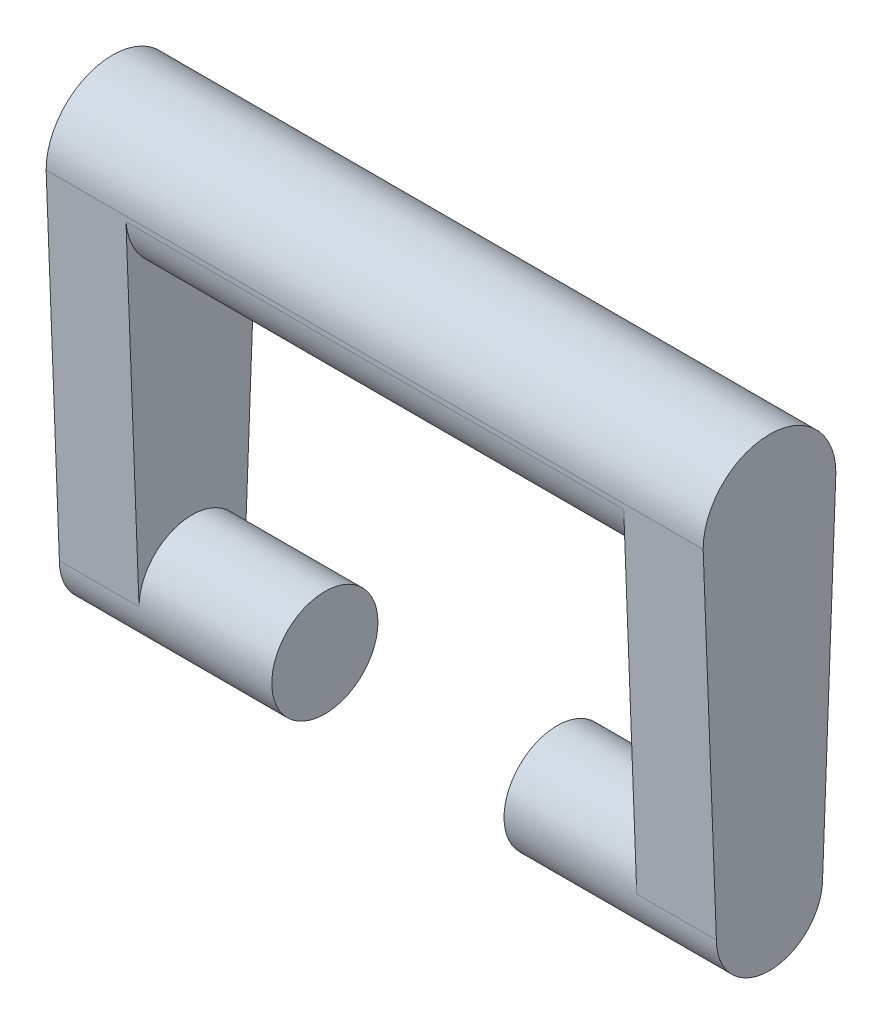
ISO-10303-21;
HEADER;
FILE_DESCRIPTION(('STEP AP214'),'2;1');
FILE_NAME('part.step','',(''),(''),'','','');
FILE_SCHEMA(('AUTOMOTIVE_DESIGN { 1 0 10303 214 1 1 1 1 }'));
ENDSEC;
DATA;
#1=APPLICATION_CONTEXT('core data for automotive mechanical design processes');
#2=APPLICATION_PROTOCOL_DEFINITION('international standard','automotive_design',2000,#1);
#3=PRODUCT_CONTEXT('',#1,'mechanical');
#4=PRODUCT('Part','Part','',(#3));
#5=PRODUCT_RELATED_PRODUCT_CATEGORY('part','',(#4));
#6=PRODUCT_DEFINITION_FORMATION('','',#4);
#7=PRODUCT_DEFINITION_CONTEXT('part definition',#1,'design');
#8=PRODUCT_DEFINITION('design','',#6,#7);
#9=PRODUCT_DEFINITION_SHAPE('','',#8);
#10=(LENGTH_UNIT() NAMED_UNIT(*) SI_UNIT(.MILLI.,.METRE.));
#11=(NAMED_UNIT(*) PLANE_ANGLE_UNIT() SI_UNIT($,.RADIAN.));
#12=(NAMED_UNIT(*) SI_UNIT($,.STERADIAN.) SOLID_ANGLE_UNIT());
#13=UNCERTAINTY_MEASURE_WITH_UNIT(LENGTH_MEASURE(1.E-05),#10,'distance_accuracy_value','');
#14=(GEOMETRIC_REPRESENTATION_CONTEXT(3) GLOBAL_UNCERTAINTY_ASSIGNED_CONTEXT((#13)) GLOBAL_UNIT_ASSIGNED_CONTEXT((#10,
#11,#12)) REPRESENTATION_CONTEXT('',''));
#15=CARTESIAN_POINT('',(0.,0.,0.));
#16=DIRECTION('',(0.,0.,1.));
#17=DIRECTION('',(1.,0.,0.));
#18=AXIS2_PLACEMENT_3D('',#15,#16,#17);
#19=CARTESIAN_POINT('',(15.24,-0.440841949778436,-11.4618906942393));
#20=DIRECTION('',(0.,-0.0384331221012046,-0.999261174631314));
#21=DIRECTION('',(0.,0.999261174631314,-0.0384331221012046));
#22=AXIS2_PLACEMENT_3D('',#19,#20,#21);
#23=PLANE('',#22);
#24=DIRECTION('',(-1.,0.,0.));
#25=VECTOR('',#24,1.);
#26=CARTESIAN_POINT('',(62.865,30.7745199409157,-12.6624815361891));
#27=LINE('',#26,#25);
#28=CARTESIAN_POINT('',(110.49,30.7745199409157,-12.6624815361891));
#29=VERTEX_POINT('',#28);
#30=CARTESIAN_POINT('',(15.24,30.7745199409157,-12.6624815361891));
#31=VERTEX_POINT('',#30);
#32=EDGE_CURVE('E166',#29,#31,#27,.T.);
#33=ORIENTED_EDGE('',*,*,#32,.T.);
#34=DIRECTION('',(0.,-0.999261174631314,0.0384331221012046));
#35=VECTOR('',#34,1.);
#36=CARTESIAN_POINT('',(15.24,-0.440841949778436,-11.4618906942393));
#37=LINE('',#36,#35);
#38=CARTESIAN_POINT('',(15.24,-34.29,-10.16));
#39=VERTEX_POINT('',#38);
#40=EDGE_CURVE('E110',#31,#39,#37,.T.);
#41=ORIENTED_EDGE('',*,*,#40,.T.);
#42=DIRECTION('',(-1.,0.,0.));
#43=VECTOR('',#42,1.);
#44=CARTESIAN_POINT('',(15.24,-34.29,-10.16));
#45=LINE('',#44,#43);
#46=CARTESIAN_POINT('',(0.,-34.29,-10.16));
#47=VERTEX_POINT('',#46);
#48=EDGE_CURVE('E104',#39,#47,#45,.T.);
#49=ORIENTED_EDGE('',*,*,#48,.T.);
#50=DIRECTION('',(0.,-0.999261174631314,0.0384331221012046));
#51=VECTOR('',#50,1.);
#52=CARTESIAN_POINT('',(0.,-0.440841949778436,-11.4618906942393));
#53=LINE('',#52,#51);
#54=CARTESIAN_POINT('',(0.,31.7499999999997,-12.7));
#55=VERTEX_POINT('',#54);
#56=EDGE_CURVE('E108',#55,#47,#53,.T.);
#57=ORIENTED_EDGE('',*,*,#56,.F.);
#58=DIRECTION('',(-1.,0.,0.));
#59=VECTOR('',#58,1.);
#60=CARTESIAN_POINT('',(15.24,31.7499999999997,-12.7));
#61=LINE('',#60,#59);
#62=CARTESIAN_POINT('',(125.73,31.7499999999997,-12.7));
#63=VERTEX_POINT('',#62);
#64=EDGE_CURVE('E11',#63,#55,#61,.T.);
#65=ORIENTED_EDGE('',*,*,#64,.F.);
#66=DIRECTION('',(0.,-0.999261174631314,0.0384331221012046));
#67=VECTOR('',#66,1.);
#68=CARTESIAN_POINT('',(125.73,-0.440841949778436,-11.4618906942393));
#69=LINE('',#68,#67);
#70=CARTESIAN_POINT('',(125.73,-34.29,-10.16));
#71=VERTEX_POINT('',#70);
#72=EDGE_CURVE('E132',#63,#71,#69,.T.);
#73=ORIENTED_EDGE('',*,*,#72,.T.);
#74=DIRECTION('',(1.,0.,0.));
#75=VECTOR('',#74,1.);
#76=CARTESIAN_POINT('',(110.49,-34.29,-10.16));
#77=LINE('',#76,#75);
#78=CARTESIAN_POINT('',(110.49,-34.29,-10.16));
#79=VERTEX_POINT('',#78);
#80=EDGE_CURVE('E157',#79,#71,#77,.T.);
#81=ORIENTED_EDGE('',*,*,#80,.F.);
#82=DIRECTION('',(0.,-0.999261174631314,0.0384331221012046));
#83=VECTOR('',#82,1.);
#84=CARTESIAN_POINT('',(110.49,-0.440841949778436,-11.4618906942393));
#85=LINE('',#84,#83);
#86=EDGE_CURVE('E156',#29,#79,#85,.T.);
#87=ORIENTED_EDGE('',*,*,#86,.F.);
#88=EDGE_LOOP('',(#33,#41,#49,#57,#65,#73,#81,#87));
#89=FACE_BOUND('',#88,.T.);
#90=ADVANCED_FACE('F44',(#89),#23,.T.);
#91=CARTESIAN_POINT('',(15.24,31.75,0.));
#92=DIRECTION('',(-1.,0.,0.));
#93=DIRECTION('',(0.,0.,1.));
#94=AXIS2_PLACEMENT_3D('',#91,#92,#93);
#95=CYLINDRICAL_SURFACE('',#94,12.7);
#96=CARTESIAN_POINT('',(0.,31.75,0.));
#97=DIRECTION('',(1.,0.,0.));
#98=DIRECTION('',(0.,0.,-1.));
#99=AXIS2_PLACEMENT_3D('',#96,#97,#98);
#100=CIRCLE('',#99,12.7);
#101=CARTESIAN_POINT('',(0.,31.75,12.7));
#102=VERTEX_POINT('',#101);
#103=EDGE_CURVE('E97',#55,#102,#100,.T.);
#104=ORIENTED_EDGE('',*,*,#103,.T.);
#105=DIRECTION('',(-1.,0.,0.));
#106=VECTOR('',#105,1.);
#107=CARTESIAN_POINT('',(15.24,31.75,12.7));
#108=LINE('',#107,#106);
#109=CARTESIAN_POINT('',(125.73,31.75,12.7));
#110=VERTEX_POINT('',#109);
#111=EDGE_CURVE('E51',#110,#102,#108,.T.);
#112=ORIENTED_EDGE('',*,*,#111,.F.);
#113=CARTESIAN_POINT('',(125.73,31.75,0.));
#114=DIRECTION('',(1.,0.,0.));
#115=DIRECTION('',(0.,0.,-1.));
#116=AXIS2_PLACEMENT_3D('',#113,#114,#115);
#117=CIRCLE('',#116,12.7);
#118=EDGE_CURVE('E136',#63,#110,#117,.T.);
#119=ORIENTED_EDGE('',*,*,#118,.F.);
#120=ORIENTED_EDGE('',*,*,#64,.T.);
#121=EDGE_LOOP('',(#104,#112,#119,#120));
#122=FACE_BOUND('',#121,.T.);
#123=ADVANCED_FACE('F122',(#122),#95,.T.);
#124=CARTESIAN_POINT('',(15.24,-0.440841949778435,11.4618906942393));
#125=DIRECTION('',(0.,0.0384331221012045,-0.999261174631314));
#126=DIRECTION('',(0.,0.999261174631314,0.0384331221012045));
#127=AXIS2_PLACEMENT_3D('',#124,#125,#126);
#128=PLANE('',#127);
#129=DIRECTION('',(0.,-0.999261174631314,-0.0384331221012045));
#130=VECTOR('',#129,1.);
#131=CARTESIAN_POINT('',(0.,-0.440841949778435,11.4618906942393));
#132=LINE('',#131,#130);
#133=CARTESIAN_POINT('',(0.,-34.29,10.16));
#134=VERTEX_POINT('',#133);
#135=EDGE_CURVE('E85',#102,#134,#132,.T.);
#136=ORIENTED_EDGE('',*,*,#135,.T.);
#137=DIRECTION('',(-1.,0.,0.));
#138=VECTOR('',#137,1.);
#139=CARTESIAN_POINT('',(15.24,-34.29,10.16));
#140=LINE('',#139,#138);
#141=CARTESIAN_POINT('',(15.24,-34.29,10.16));
#142=VERTEX_POINT('',#141);
#143=EDGE_CURVE('E90',#142,#134,#140,.T.);
#144=ORIENTED_EDGE('',*,*,#143,.F.);
#145=DIRECTION('',(0.,-0.999261174631314,-0.0384331221012045));
#146=VECTOR('',#145,1.);
#147=CARTESIAN_POINT('',(15.24,-0.440841949778435,11.4618906942393));
#148=LINE('',#147,#146);
#149=CARTESIAN_POINT('',(15.24,30.7745199409157,12.6624815361891));
#150=VERTEX_POINT('',#149);
#151=EDGE_CURVE('E112',#150,#142,#148,.T.);
#152=ORIENTED_EDGE('',*,*,#151,.F.);
#153=DIRECTION('',(-1.,0.,0.));
#154=VECTOR('',#153,1.);
#155=CARTESIAN_POINT('',(62.865,30.7745199409157,12.6624815361891));
#156=LINE('',#155,#154);
#157=CARTESIAN_POINT('',(110.49,30.7745199409157,12.6624815361891));
#158=VERTEX_POINT('',#157);
#159=EDGE_CURVE('E58',#158,#150,#156,.T.);
#160=ORIENTED_EDGE('',*,*,#159,.F.);
#161=DIRECTION('',(0.,-0.999261174631314,-0.0384331221012045));
#162=VECTOR('',#161,1.);
#163=CARTESIAN_POINT('',(110.49,-0.440841949778435,11.4618906942393));
#164=LINE('',#163,#162);
#165=CARTESIAN_POINT('',(110.49,-34.29,10.16));
#166=VERTEX_POINT('',#165);
#167=EDGE_CURVE('E151',#158,#166,#164,.T.);
#168=ORIENTED_EDGE('',*,*,#167,.T.);
#169=DIRECTION('',(1.,0.,0.));
#170=VECTOR('',#169,1.);
#171=CARTESIAN_POINT('',(110.49,-34.29,10.16));
#172=LINE('',#171,#170);
#173=CARTESIAN_POINT('',(125.73,-34.29,10.16));
#174=VERTEX_POINT('',#173);
#175=EDGE_CURVE('E159',#166,#174,#172,.T.);
#176=ORIENTED_EDGE('',*,*,#175,.T.);
#177=DIRECTION('',(0.,-0.999261174631314,-0.0384331221012045));
#178=VECTOR('',#177,1.);
#179=CARTESIAN_POINT('',(125.73,-0.440841949778435,11.4618906942393));
#180=LINE('',#179,#178);
#181=EDGE_CURVE('E139',#110,#174,#180,.T.);
#182=ORIENTED_EDGE('',*,*,#181,.F.);
#183=ORIENTED_EDGE('',*,*,#111,.T.);
#184=EDGE_LOOP('',(#136,#144,#152,#160,#168,#176,#182,#183));
#185=FACE_BOUND('',#184,.T.);
#186=ADVANCED_FACE('F87',(#185),#128,.F.);
#187=CARTESIAN_POINT('',(15.24,-34.29,0.));
#188=DIRECTION('',(-1.,0.,0.));
#189=DIRECTION('',(0.,0.,1.));
#190=AXIS2_PLACEMENT_3D('',#187,#188,#189);
#191=CYLINDRICAL_SURFACE('',#190,10.16);
#192=CARTESIAN_POINT('',(0.,-34.29,0.));
#193=DIRECTION('',(1.,0.,0.));
#194=DIRECTION('',(0.,0.,-1.));
#195=AXIS2_PLACEMENT_3D('',#192,#193,#194);
#196=CIRCLE('',#195,10.16);
#197=EDGE_CURVE('E96',#134,#47,#196,.T.);
#198=ORIENTED_EDGE('',*,*,#197,.T.);
#199=ORIENTED_EDGE('',*,*,#48,.F.);
#200=CARTESIAN_POINT('',(15.24,-34.29,0.));
#201=DIRECTION('',(1.,0.,0.));
#202=DIRECTION('',(0.,0.,-1.));
#203=AXIS2_PLACEMENT_3D('',#200,#201,#202);
#204=CIRCLE('',#203,10.16);
#205=EDGE_CURVE('E67',#142,#39,#204,.F.);
#206=ORIENTED_EDGE('',*,*,#205,.F.);
#207=ORIENTED_EDGE('',*,*,#143,.T.);
#208=EDGE_LOOP('',(#198,#199,#206,#207));
#209=FACE_BOUND('',#208,.T.);
#210=CARTESIAN_POINT('',(40.64,-34.29,0.));
#211=DIRECTION('',(1.,0.,0.));
#212=DIRECTION('',(0.,0.,-1.));
#213=AXIS2_PLACEMENT_3D('',#210,#211,#212);
#214=CIRCLE('',#213,10.16);
#215=CARTESIAN_POINT('',(40.64,-34.29,-10.16));
#216=VERTEX_POINT('',#215);
#217=EDGE_CURVE('E162',#216,#216,#214,.T.);
#218=ORIENTED_EDGE('',*,*,#217,.F.);
#219=EDGE_LOOP('',(#218));
#220=FACE_BOUND('',#219,.T.);
#221=ADVANCED_FACE('F101',(#209,#220),#191,.T.);
#222=CARTESIAN_POINT('',(15.24,0.,0.));
#223=DIRECTION('',(1.,0.,0.));
#224=DIRECTION('',(0.,0.,-1.));
#225=AXIS2_PLACEMENT_3D('',#222,#223,#224);
#226=PLANE('',#225);
#227=ORIENTED_EDGE('',*,*,#151,.T.);
#228=ORIENTED_EDGE('',*,*,#205,.T.);
#229=ORIENTED_EDGE('',*,*,#40,.F.);
#230=CARTESIAN_POINT('',(15.24,31.75,0.));
#231=DIRECTION('',(1.,0.,0.));
#232=DIRECTION('',(0.,0.,-1.));
#233=AXIS2_PLACEMENT_3D('',#230,#231,#232);
#234=CIRCLE('',#233,12.7);
#235=EDGE_CURVE('E120',#31,#150,#234,.F.);
#236=ORIENTED_EDGE('',*,*,#235,.T.);
#237=EDGE_LOOP('',(#227,#228,#229,#236));
#238=FACE_BOUND('',#237,.T.);
#239=ADVANCED_FACE('F168',(#238),#226,.T.);
#240=CARTESIAN_POINT('',(0.,0.,0.));
#241=DIRECTION('',(1.,0.,0.));
#242=DIRECTION('',(0.,0.,-1.));
#243=AXIS2_PLACEMENT_3D('',#240,#241,#242);
#244=PLANE('',#243);
#245=ORIENTED_EDGE('',*,*,#56,.T.);
#246=ORIENTED_EDGE('',*,*,#197,.F.);
#247=ORIENTED_EDGE('',*,*,#135,.F.);
#248=ORIENTED_EDGE('',*,*,#103,.F.);
#249=EDGE_LOOP('',(#245,#246,#247,#248));
#250=FACE_BOUND('',#249,.T.);
#251=ADVANCED_FACE('F106',(#250),#244,.F.);
#252=CARTESIAN_POINT('',(62.865,31.75,0.));
#253=DIRECTION('',(-1.,0.,0.));
#254=DIRECTION('',(0.,0.,1.));
#255=AXIS2_PLACEMENT_3D('',#252,#253,#254);
#256=CYLINDRICAL_SURFACE('',#255,12.7);
#257=ORIENTED_EDGE('',*,*,#235,.F.);
#258=ORIENTED_EDGE('',*,*,#32,.F.);
#259=CARTESIAN_POINT('',(110.49,31.75,0.));
#260=DIRECTION('',(1.,0.,0.));
#261=DIRECTION('',(0.,0.,-1.));
#262=AXIS2_PLACEMENT_3D('',#259,#260,#261);
#263=CIRCLE('',#262,12.7);
#264=EDGE_CURVE('E146',#29,#158,#263,.F.);
#265=ORIENTED_EDGE('',*,*,#264,.T.);
#266=ORIENTED_EDGE('',*,*,#159,.T.);
#267=EDGE_LOOP('',(#257,#258,#265,#266));
#268=FACE_BOUND('',#267,.T.);
#269=ADVANCED_FACE('F177',(#268),#256,.T.);
#270=CARTESIAN_POINT('',(40.64,0.,0.));
#271=DIRECTION('',(1.,0.,0.));
#272=DIRECTION('',(0.,0.,-1.));
#273=AXIS2_PLACEMENT_3D('',#270,#271,#272);
#274=PLANE('',#273);
#275=ORIENTED_EDGE('',*,*,#217,.T.);
#276=EDGE_LOOP('',(#275));
#277=FACE_BOUND('',#276,.T.);
#278=ADVANCED_FACE('F219',(#277),#274,.T.);
#279=CARTESIAN_POINT('',(110.49,-34.29,0.));
#280=DIRECTION('',(1.,0.,0.));
#281=DIRECTION('',(0.,0.,1.));
#282=AXIS2_PLACEMENT_3D('',#279,#280,#281);
#283=CYLINDRICAL_SURFACE('',#282,10.16);
#284=CARTESIAN_POINT('',(125.73,-34.29,0.));
#285=DIRECTION('',(1.,0.,0.));
#286=DIRECTION('',(0.,0.,-1.));
#287=AXIS2_PLACEMENT_3D('',#284,#285,#286);
#288=CIRCLE('',#287,10.16);
#289=EDGE_CURVE('E144',#174,#71,#288,.T.);
#290=ORIENTED_EDGE('',*,*,#289,.F.);
#291=ORIENTED_EDGE('',*,*,#175,.F.);
#292=CARTESIAN_POINT('',(110.49,-34.29,0.));
#293=DIRECTION('',(1.,0.,0.));
#294=DIRECTION('',(0.,0.,-1.));
#295=AXIS2_PLACEMENT_3D('',#292,#293,#294);
#296=CIRCLE('',#295,10.16);
#297=EDGE_CURVE('E148',#166,#79,#296,.F.);
#298=ORIENTED_EDGE('',*,*,#297,.T.);
#299=ORIENTED_EDGE('',*,*,#80,.T.);
#300=EDGE_LOOP('',(#290,#291,#298,#299));
#301=FACE_BOUND('',#300,.T.);
#302=CARTESIAN_POINT('',(85.09,-34.29,0.));
#303=DIRECTION('',(1.,0.,0.));
#304=DIRECTION('',(0.,0.,-1.));
#305=AXIS2_PLACEMENT_3D('',#302,#303,#304);
#306=CIRCLE('',#305,10.16);
#307=CARTESIAN_POINT('',(85.09,-34.29,-10.16));
#308=VERTEX_POINT('',#307);
#309=EDGE_CURVE('E187',#308,#308,#306,.T.);
#310=ORIENTED_EDGE('',*,*,#309,.T.);
#311=EDGE_LOOP('',(#310));
#312=FACE_BOUND('',#311,.T.);
#313=ADVANCED_FACE('F191',(#301,#312),#283,.T.);
#314=CARTESIAN_POINT('',(110.49,0.,0.));
#315=DIRECTION('',(-1.,0.,0.));
#316=DIRECTION('',(0.,0.,-1.));
#317=AXIS2_PLACEMENT_3D('',#314,#315,#316);
#318=PLANE('',#317);
#319=ORIENTED_EDGE('',*,*,#167,.F.);
#320=ORIENTED_EDGE('',*,*,#264,.F.);
#321=ORIENTED_EDGE('',*,*,#86,.T.);
#322=ORIENTED_EDGE('',*,*,#297,.F.);
#323=EDGE_LOOP('',(#319,#320,#321,#322));
#324=FACE_BOUND('',#323,.T.);
#325=ADVANCED_FACE('F182',(#324),#318,.T.);
#326=CARTESIAN_POINT('',(125.73,0.,0.));
#327=DIRECTION('',(-1.,0.,0.));
#328=DIRECTION('',(0.,0.,-1.));
#329=AXIS2_PLACEMENT_3D('',#326,#327,#328);
#330=PLANE('',#329);
#331=ORIENTED_EDGE('',*,*,#72,.F.);
#332=ORIENTED_EDGE('',*,*,#118,.T.);
#333=ORIENTED_EDGE('',*,*,#181,.T.);
#334=ORIENTED_EDGE('',*,*,#289,.T.);
#335=EDGE_LOOP('',(#331,#332,#333,#334));
#336=FACE_BOUND('',#335,.T.);
#337=ADVANCED_FACE('F142',(#336),#330,.F.);
#338=CARTESIAN_POINT('',(85.09,0.,0.));
#339=DIRECTION('',(-1.,0.,0.));
#340=DIRECTION('',(0.,0.,-1.));
#341=AXIS2_PLACEMENT_3D('',#338,#339,#340);
#342=PLANE('',#341);
#343=ORIENTED_EDGE('',*,*,#309,.F.);
#344=EDGE_LOOP('',(#343));
#345=FACE_BOUND('',#344,.T.);
#346=ADVANCED_FACE('F193',(#345),#342,.T.);
#347=CLOSED_SHELL('',(#90,#123,#186,#221,#239,#251,#269,#278,#313,#325,#337,#346));
#348=MANIFOLD_SOLID_BREP('B2',#347);
#349=ADVANCED_BREP_SHAPE_REPRESENTATION('',(#18,#348),#14);
#350=SHAPE_DEFINITION_REPRESENTATION(#9,#349);
ENDSEC;
END-ISO-10303-21;
